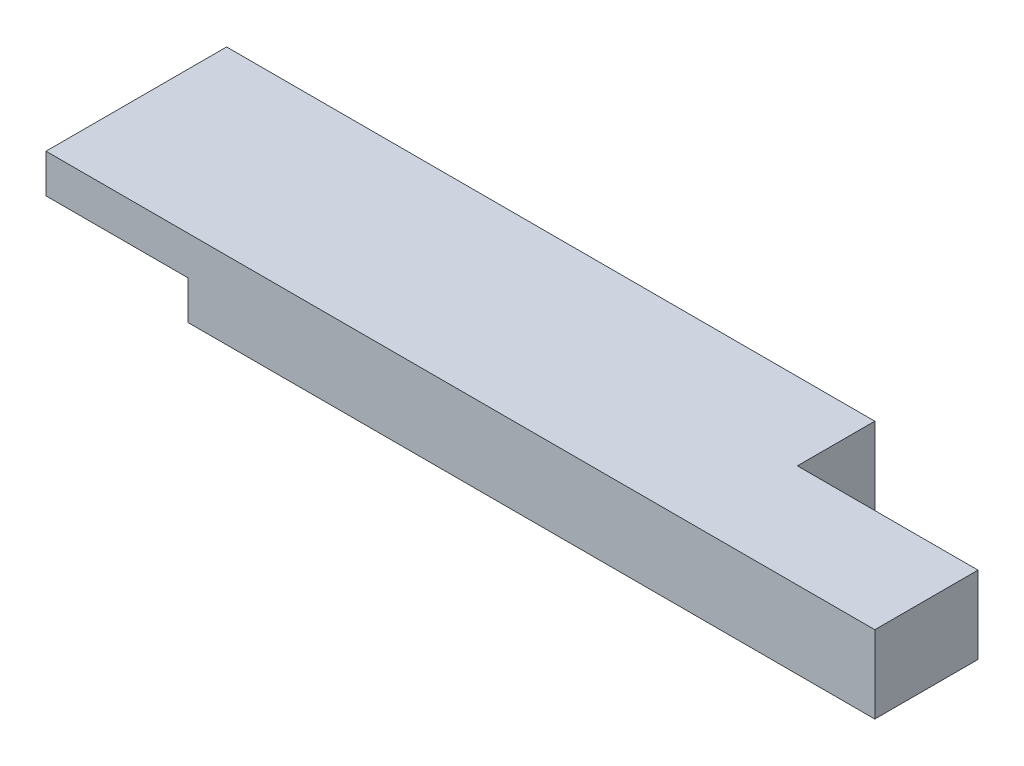
ISO-10303-21;
HEADER;
FILE_DESCRIPTION(('STEP AP214'),'2;1');
FILE_NAME('part.step','',(''),(''),'','','');
FILE_SCHEMA(('AUTOMOTIVE_DESIGN { 1 0 10303 214 1 1 1 1 }'));
ENDSEC;
DATA;
#1=APPLICATION_CONTEXT('core data for automotive mechanical design processes');
#2=APPLICATION_PROTOCOL_DEFINITION('international standard','automotive_design',2000,#1);
#3=PRODUCT_CONTEXT('',#1,'mechanical');
#4=PRODUCT('Part','Part','',(#3));
#5=PRODUCT_RELATED_PRODUCT_CATEGORY('part','',(#4));
#6=PRODUCT_DEFINITION_FORMATION('','',#4);
#7=PRODUCT_DEFINITION_CONTEXT('part definition',#1,'design');
#8=PRODUCT_DEFINITION('design','',#6,#7);
#9=PRODUCT_DEFINITION_SHAPE('','',#8);
#10=(LENGTH_UNIT() NAMED_UNIT(*) SI_UNIT(.MILLI.,.METRE.));
#11=(NAMED_UNIT(*) PLANE_ANGLE_UNIT() SI_UNIT($,.RADIAN.));
#12=(NAMED_UNIT(*) SI_UNIT($,.STERADIAN.) SOLID_ANGLE_UNIT());
#13=UNCERTAINTY_MEASURE_WITH_UNIT(LENGTH_MEASURE(1.E-05),#10,'distance_accuracy_value','');
#14=(GEOMETRIC_REPRESENTATION_CONTEXT(3) GLOBAL_UNCERTAINTY_ASSIGNED_CONTEXT((#13)) GLOBAL_UNIT_ASSIGNED_CONTEXT((#10,
#11,#12)) REPRESENTATION_CONTEXT('',''));
#15=CARTESIAN_POINT('',(0.,0.,0.));
#16=DIRECTION('',(0.,0.,1.));
#17=DIRECTION('',(1.,0.,0.));
#18=AXIS2_PLACEMENT_3D('',#15,#16,#17);
#19=CARTESIAN_POINT('',(0.,38.1,0.));
#20=DIRECTION('',(1.,0.,0.));
#21=DIRECTION('',(0.,0.,-1.));
#22=AXIS2_PLACEMENT_3D('',#19,#20,#21);
#23=PLANE('',#22);
#24=DIRECTION('',(0.,0.,1.));
#25=VECTOR('',#24,1.);
#26=CARTESIAN_POINT('',(0.,19.0500000000025,-88.9));
#27=LINE('',#26,#25);
#28=CARTESIAN_POINT('',(0.,19.0500000000025,-88.9));
#29=VERTEX_POINT('',#28);
#30=CARTESIAN_POINT('',(0.,19.0500000000025,0.));
#31=VERTEX_POINT('',#30);
#32=EDGE_CURVE('E103',#29,#31,#27,.T.);
#33=ORIENTED_EDGE('',*,*,#32,.T.);
#34=DIRECTION('',(0.,-1.,0.));
#35=VECTOR('',#34,1.);
#36=CARTESIAN_POINT('',(0.,38.1,0.));
#37=LINE('',#36,#35);
#38=CARTESIAN_POINT('',(0.,38.1,0.));
#39=VERTEX_POINT('',#38);
#40=EDGE_CURVE('E11',#39,#31,#37,.T.);
#41=ORIENTED_EDGE('',*,*,#40,.F.);
#42=DIRECTION('',(0.,0.,1.));
#43=VECTOR('',#42,1.);
#44=CARTESIAN_POINT('',(0.,38.1,0.));
#45=LINE('',#44,#43);
#46=CARTESIAN_POINT('',(0.,38.1,-88.9));
#47=VERTEX_POINT('',#46);
#48=EDGE_CURVE('E125',#47,#39,#45,.T.);
#49=ORIENTED_EDGE('',*,*,#48,.F.);
#50=DIRECTION('',(0.,-1.,0.));
#51=VECTOR('',#50,1.);
#52=CARTESIAN_POINT('',(0.,38.1,-88.9));
#53=LINE('',#52,#51);
#54=EDGE_CURVE('E119',#47,#29,#53,.T.);
#55=ORIENTED_EDGE('',*,*,#54,.T.);
#56=EDGE_LOOP('',(#33,#41,#49,#55));
#57=FACE_BOUND('',#56,.T.);
#58=ADVANCED_FACE('F39',(#57),#23,.F.);
#59=CARTESIAN_POINT('',(0.,38.1,0.));
#60=DIRECTION('',(0.,0.,-1.));
#61=DIRECTION('',(-1.,0.,0.));
#62=AXIS2_PLACEMENT_3D('',#59,#60,#61);
#63=PLANE('',#62);
#64=DIRECTION('',(1.,0.,0.));
#65=VECTOR('',#64,1.);
#66=CARTESIAN_POINT('',(0.,19.0500000000025,0.));
#67=LINE('',#66,#65);
#68=CARTESIAN_POINT('',(69.85,19.0500000000025,0.));
#69=VERTEX_POINT('',#68);
#70=EDGE_CURVE('E108',#31,#69,#67,.T.);
#71=ORIENTED_EDGE('',*,*,#70,.T.);
#72=DIRECTION('',(0.,1.,0.));
#73=VECTOR('',#72,1.);
#74=CARTESIAN_POINT('',(69.85,0.,0.));
#75=LINE('',#74,#73);
#76=CARTESIAN_POINT('',(69.85,0.,0.));
#77=VERTEX_POINT('',#76);
#78=EDGE_CURVE('E122',#77,#69,#75,.T.);
#79=ORIENTED_EDGE('',*,*,#78,.F.);
#80=DIRECTION('',(1.,0.,0.));
#81=VECTOR('',#80,1.);
#82=CARTESIAN_POINT('',(0.,0.,0.));
#83=LINE('',#82,#81);
#84=CARTESIAN_POINT('',(407.9875,0.,0.));
#85=VERTEX_POINT('',#84);
#86=EDGE_CURVE('E137',#77,#85,#83,.T.);
#87=ORIENTED_EDGE('',*,*,#86,.T.);
#88=DIRECTION('',(0.,-1.,0.));
#89=VECTOR('',#88,1.);
#90=CARTESIAN_POINT('',(407.9875,38.1,0.));
#91=LINE('',#90,#89);
#92=CARTESIAN_POINT('',(407.9875,38.1,0.));
#93=VERTEX_POINT('',#92);
#94=EDGE_CURVE('E46',#93,#85,#91,.T.);
#95=ORIENTED_EDGE('',*,*,#94,.F.);
#96=DIRECTION('',(1.,0.,0.));
#97=VECTOR('',#96,1.);
#98=CARTESIAN_POINT('',(0.,38.1,0.));
#99=LINE('',#98,#97);
#100=EDGE_CURVE('E142',#39,#93,#99,.T.);
#101=ORIENTED_EDGE('',*,*,#100,.F.);
#102=ORIENTED_EDGE('',*,*,#40,.T.);
#103=EDGE_LOOP('',(#71,#79,#87,#95,#101,#102));
#104=FACE_BOUND('',#103,.T.);
#105=ADVANCED_FACE('F167',(#104),#63,.F.);
#106=CARTESIAN_POINT('',(0.,38.1,-88.9));
#107=DIRECTION('',(0.,0.,1.));
#108=DIRECTION('',(1.,0.,0.));
#109=AXIS2_PLACEMENT_3D('',#106,#107,#108);
#110=PLANE('',#109);
#111=DIRECTION('',(1.,0.,0.));
#112=VECTOR('',#111,1.);
#113=CARTESIAN_POINT('',(0.,19.0500000000025,-88.9));
#114=LINE('',#113,#112);
#115=CARTESIAN_POINT('',(69.85,19.0500000000025,-88.9));
#116=VERTEX_POINT('',#115);
#117=EDGE_CURVE('E106',#29,#116,#114,.T.);
#118=ORIENTED_EDGE('',*,*,#117,.F.);
#119=ORIENTED_EDGE('',*,*,#54,.F.);
#120=DIRECTION('',(-1.,0.,0.));
#121=VECTOR('',#120,1.);
#122=CARTESIAN_POINT('',(0.,38.1,-88.9));
#123=LINE('',#122,#121);
#124=CARTESIAN_POINT('',(319.0875,38.1,-88.9));
#125=VERTEX_POINT('',#124);
#126=EDGE_CURVE('E126',#125,#47,#123,.T.);
#127=ORIENTED_EDGE('',*,*,#126,.F.);
#128=DIRECTION('',(0.,1.,0.));
#129=VECTOR('',#128,1.);
#130=CARTESIAN_POINT('',(319.0875,0.,-88.9));
#131=LINE('',#130,#129);
#132=CARTESIAN_POINT('',(319.0875,0.,-88.9));
#133=VERTEX_POINT('',#132);
#134=EDGE_CURVE('E145',#133,#125,#131,.T.);
#135=ORIENTED_EDGE('',*,*,#134,.F.);
#136=DIRECTION('',(-1.,0.,0.));
#137=VECTOR('',#136,1.);
#138=CARTESIAN_POINT('',(0.,0.,-88.9));
#139=LINE('',#138,#137);
#140=CARTESIAN_POINT('',(69.85,0.,-88.9));
#141=VERTEX_POINT('',#140);
#142=EDGE_CURVE('E132',#133,#141,#139,.T.);
#143=ORIENTED_EDGE('',*,*,#142,.T.);
#144=DIRECTION('',(0.,1.,0.));
#145=VECTOR('',#144,1.);
#146=CARTESIAN_POINT('',(69.85,0.,-88.9));
#147=LINE('',#146,#145);
#148=EDGE_CURVE('E53',#141,#116,#147,.T.);
#149=ORIENTED_EDGE('',*,*,#148,.T.);
#150=EDGE_LOOP('',(#118,#119,#127,#135,#143,#149));
#151=FACE_BOUND('',#150,.T.);
#152=ADVANCED_FACE('F117',(#151),#110,.F.);
#153=CARTESIAN_POINT('',(407.9875,38.1,0.));
#154=DIRECTION('',(-1.,0.,0.));
#155=DIRECTION('',(0.,0.,1.));
#156=AXIS2_PLACEMENT_3D('',#153,#154,#155);
#157=PLANE('',#156);
#158=DIRECTION('',(0.,0.,-1.));
#159=VECTOR('',#158,1.);
#160=CARTESIAN_POINT('',(407.9875,0.,0.));
#161=LINE('',#160,#159);
#162=CARTESIAN_POINT('',(407.9875,0.,-50.8));
#163=VERTEX_POINT('',#162);
#164=EDGE_CURVE('E134',#85,#163,#161,.T.);
#165=ORIENTED_EDGE('',*,*,#164,.T.);
#166=DIRECTION('',(0.,1.,0.));
#167=VECTOR('',#166,1.);
#168=CARTESIAN_POINT('',(407.9875,0.,-50.8));
#169=LINE('',#168,#167);
#170=CARTESIAN_POINT('',(407.9875,38.1,-50.8));
#171=VERTEX_POINT('',#170);
#172=EDGE_CURVE('E138',#163,#171,#169,.T.);
#173=ORIENTED_EDGE('',*,*,#172,.T.);
#174=DIRECTION('',(0.,0.,-1.));
#175=VECTOR('',#174,1.);
#176=CARTESIAN_POINT('',(407.9875,38.1,0.));
#177=LINE('',#176,#175);
#178=EDGE_CURVE('E129',#93,#171,#177,.T.);
#179=ORIENTED_EDGE('',*,*,#178,.F.);
#180=ORIENTED_EDGE('',*,*,#94,.T.);
#181=EDGE_LOOP('',(#165,#173,#179,#180));
#182=FACE_BOUND('',#181,.T.);
#183=ADVANCED_FACE('F197',(#182),#157,.F.);
#184=CARTESIAN_POINT('',(0.,38.1,0.));
#185=DIRECTION('',(0.,-1.,0.));
#186=DIRECTION('',(0.,0.,-1.));
#187=AXIS2_PLACEMENT_3D('',#184,#185,#186);
#188=PLANE('',#187);
#189=ORIENTED_EDGE('',*,*,#178,.T.);
#190=DIRECTION('',(1.,0.,0.));
#191=VECTOR('',#190,1.);
#192=CARTESIAN_POINT('',(407.9875,38.1,-50.8));
#193=LINE('',#192,#191);
#194=CARTESIAN_POINT('',(319.0875,38.1,-50.8));
#195=VERTEX_POINT('',#194);
#196=EDGE_CURVE('E151',#195,#171,#193,.T.);
#197=ORIENTED_EDGE('',*,*,#196,.F.);
#198=DIRECTION('',(0.,0.,1.));
#199=VECTOR('',#198,1.);
#200=CARTESIAN_POINT('',(319.0875,38.1,-88.9));
#201=LINE('',#200,#199);
#202=EDGE_CURVE('E112',#125,#195,#201,.T.);
#203=ORIENTED_EDGE('',*,*,#202,.F.);
#204=ORIENTED_EDGE('',*,*,#126,.T.);
#205=ORIENTED_EDGE('',*,*,#48,.T.);
#206=ORIENTED_EDGE('',*,*,#100,.T.);
#207=EDGE_LOOP('',(#189,#197,#203,#204,#205,#206));
#208=FACE_BOUND('',#207,.T.);
#209=ADVANCED_FACE('F172',(#208),#188,.F.);
#210=CARTESIAN_POINT('',(0.,0.,0.));
#211=DIRECTION('',(0.,-1.,0.));
#212=DIRECTION('',(0.,0.,-1.));
#213=AXIS2_PLACEMENT_3D('',#210,#211,#212);
#214=PLANE('',#213);
#215=DIRECTION('',(0.,0.,1.));
#216=VECTOR('',#215,1.);
#217=CARTESIAN_POINT('',(69.85,0.,-88.9));
#218=LINE('',#217,#216);
#219=EDGE_CURVE('E160',#141,#77,#218,.T.);
#220=ORIENTED_EDGE('',*,*,#219,.F.);
#221=ORIENTED_EDGE('',*,*,#142,.F.);
#222=DIRECTION('',(0.,0.,1.));
#223=VECTOR('',#222,1.);
#224=CARTESIAN_POINT('',(319.0875,0.,-88.9));
#225=LINE('',#224,#223);
#226=CARTESIAN_POINT('',(319.0875,0.,-50.8));
#227=VERTEX_POINT('',#226);
#228=EDGE_CURVE('E153',#133,#227,#225,.T.);
#229=ORIENTED_EDGE('',*,*,#228,.T.);
#230=DIRECTION('',(1.,0.,0.));
#231=VECTOR('',#230,1.);
#232=CARTESIAN_POINT('',(407.9875,0.,-50.8));
#233=LINE('',#232,#231);
#234=EDGE_CURVE('E61',#227,#163,#233,.T.);
#235=ORIENTED_EDGE('',*,*,#234,.T.);
#236=ORIENTED_EDGE('',*,*,#164,.F.);
#237=ORIENTED_EDGE('',*,*,#86,.F.);
#238=EDGE_LOOP('',(#220,#221,#229,#235,#236,#237));
#239=FACE_BOUND('',#238,.T.);
#240=ADVANCED_FACE('F179',(#239),#214,.T.);
#241=CARTESIAN_POINT('',(407.9875,0.,-50.8));
#242=DIRECTION('',(0.,0.,1.));
#243=DIRECTION('',(1.,0.,0.));
#244=AXIS2_PLACEMENT_3D('',#241,#242,#243);
#245=PLANE('',#244);
#246=ORIENTED_EDGE('',*,*,#196,.T.);
#247=ORIENTED_EDGE('',*,*,#172,.F.);
#248=ORIENTED_EDGE('',*,*,#234,.F.);
#249=DIRECTION('',(0.,1.,0.));
#250=VECTOR('',#249,1.);
#251=CARTESIAN_POINT('',(319.0875,0.,-50.8));
#252=LINE('',#251,#250);
#253=EDGE_CURVE('E147',#227,#195,#252,.T.);
#254=ORIENTED_EDGE('',*,*,#253,.T.);
#255=EDGE_LOOP('',(#246,#247,#248,#254));
#256=FACE_BOUND('',#255,.T.);
#257=ADVANCED_FACE('F205',(#256),#245,.F.);
#258=CARTESIAN_POINT('',(319.0875,0.,-88.9));
#259=DIRECTION('',(-1.,0.,0.));
#260=DIRECTION('',(0.,0.,1.));
#261=AXIS2_PLACEMENT_3D('',#258,#259,#260);
#262=PLANE('',#261);
#263=ORIENTED_EDGE('',*,*,#202,.T.);
#264=ORIENTED_EDGE('',*,*,#253,.F.);
#265=ORIENTED_EDGE('',*,*,#228,.F.);
#266=ORIENTED_EDGE('',*,*,#134,.T.);
#267=EDGE_LOOP('',(#263,#264,#265,#266));
#268=FACE_BOUND('',#267,.T.);
#269=ADVANCED_FACE('F187',(#268),#262,.F.);
#270=CARTESIAN_POINT('',(0.,19.0500000000025,-88.9));
#271=DIRECTION('',(0.,-1.,0.));
#272=DIRECTION('',(0.,0.,-1.));
#273=AXIS2_PLACEMENT_3D('',#270,#271,#272);
#274=PLANE('',#273);
#275=ORIENTED_EDGE('',*,*,#70,.F.);
#276=ORIENTED_EDGE('',*,*,#32,.F.);
#277=ORIENTED_EDGE('',*,*,#117,.T.);
#278=DIRECTION('',(0.,0.,1.));
#279=VECTOR('',#278,1.);
#280=CARTESIAN_POINT('',(69.85,19.0500000000025,-88.9));
#281=LINE('',#280,#279);
#282=EDGE_CURVE('E113',#116,#69,#281,.T.);
#283=ORIENTED_EDGE('',*,*,#282,.T.);
#284=EDGE_LOOP('',(#275,#276,#277,#283));
#285=FACE_BOUND('',#284,.T.);
#286=ADVANCED_FACE('F105',(#285),#274,.T.);
#287=CARTESIAN_POINT('',(69.85,0.,-88.9));
#288=DIRECTION('',(1.,0.,0.));
#289=DIRECTION('',(0.,0.,-1.));
#290=AXIS2_PLACEMENT_3D('',#287,#288,#289);
#291=PLANE('',#290);
#292=ORIENTED_EDGE('',*,*,#78,.T.);
#293=ORIENTED_EDGE('',*,*,#282,.F.);
#294=ORIENTED_EDGE('',*,*,#148,.F.);
#295=ORIENTED_EDGE('',*,*,#219,.T.);
#296=EDGE_LOOP('',(#292,#293,#294,#295));
#297=FACE_BOUND('',#296,.T.);
#298=ADVANCED_FACE('F181',(#297),#291,.F.);
#299=CLOSED_SHELL('',(#58,#105,#152,#183,#209,#240,#257,#269,#286,#298));
#300=MANIFOLD_SOLID_BREP('B2',#299);
#301=ADVANCED_BREP_SHAPE_REPRESENTATION('',(#18,#300),#14);
#302=SHAPE_DEFINITION_REPRESENTATION(#9,#301);
ENDSEC;
END-ISO-10303-21;
